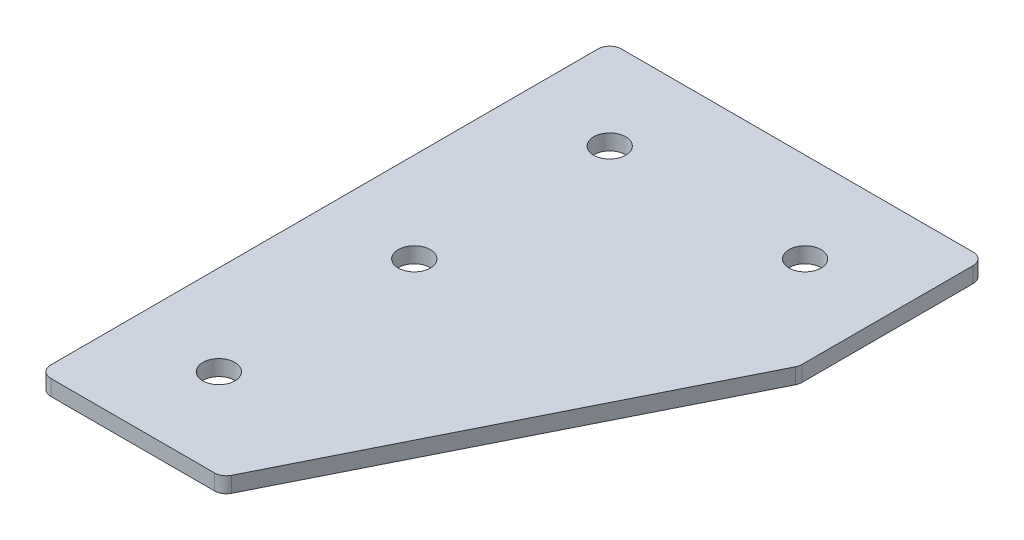
ISO-10303-21;
HEADER;
FILE_DESCRIPTION(('STEP AP214'),'2;1');
FILE_NAME('part.step','',(''),(''),'','','');
FILE_SCHEMA(('AUTOMOTIVE_DESIGN { 1 0 10303 214 1 1 1 1 }'));
ENDSEC;
DATA;
#1=APPLICATION_CONTEXT('core data for automotive mechanical design processes');
#2=APPLICATION_PROTOCOL_DEFINITION('international standard','automotive_design',2000,#1);
#3=PRODUCT_CONTEXT('',#1,'mechanical');
#4=PRODUCT('Part','Part','',(#3));
#5=PRODUCT_RELATED_PRODUCT_CATEGORY('part','',(#4));
#6=PRODUCT_DEFINITION_FORMATION('','',#4);
#7=PRODUCT_DEFINITION_CONTEXT('part definition',#1,'design');
#8=PRODUCT_DEFINITION('design','',#6,#7);
#9=PRODUCT_DEFINITION_SHAPE('','',#8);
#10=(LENGTH_UNIT() NAMED_UNIT(*) SI_UNIT(.MILLI.,.METRE.));
#11=(NAMED_UNIT(*) PLANE_ANGLE_UNIT() SI_UNIT($,.RADIAN.));
#12=(NAMED_UNIT(*) SI_UNIT($,.STERADIAN.) SOLID_ANGLE_UNIT());
#13=UNCERTAINTY_MEASURE_WITH_UNIT(LENGTH_MEASURE(1.E-05),#10,'distance_accuracy_value','');
#14=(GEOMETRIC_REPRESENTATION_CONTEXT(3) GLOBAL_UNCERTAINTY_ASSIGNED_CONTEXT((#13)) GLOBAL_UNIT_ASSIGNED_CONTEXT((#10,
#11,#12)) REPRESENTATION_CONTEXT('',''));
#15=CARTESIAN_POINT('',(0.,0.,0.));
#16=DIRECTION('',(0.,0.,1.));
#17=DIRECTION('',(1.,0.,0.));
#18=AXIS2_PLACEMENT_3D('',#15,#16,#17);
#19=CARTESIAN_POINT('',(-26.5038164553971,0.05807034319605,-50.5539194208949));
#20=DIRECTION('',(0.,-1.,0.));
#21=DIRECTION('',(0.,0.,-1.));
#22=AXIS2_PLACEMENT_3D('',#19,#20,#21);
#23=PLANE('',#22);
#24=CARTESIAN_POINT('',(-26.5038164553971,0.05807034319605,49.4460805791051));
#25=DIRECTION('',(0.,1.,0.));
#26=DIRECTION('',(0.,0.,1.));
#27=AXIS2_PLACEMENT_3D('',#24,#25,#26);
#28=CIRCLE('',#27,4.1);
#29=CARTESIAN_POINT('',(-26.5038164553971,0.05807034319605,53.5460805791051));
#30=VERTEX_POINT('',#29);
#31=EDGE_CURVE('E245',#30,#30,#28,.T.);
#32=ORIENTED_EDGE('',*,*,#31,.T.);
#33=EDGE_LOOP('',(#32));
#34=FACE_BOUND('',#33,.T.);
#35=CARTESIAN_POINT('',(-26.5038164553971,0.05807034319605,-0.553919420894944));
#36=DIRECTION('',(0.,1.,0.));
#37=DIRECTION('',(0.,0.,1.));
#38=AXIS2_PLACEMENT_3D('',#35,#36,#37);
#39=CIRCLE('',#38,4.1);
#40=CARTESIAN_POINT('',(-26.5038164553971,0.05807034319605,3.54608057910506));
#41=VERTEX_POINT('',#40);
#42=EDGE_CURVE('E253',#41,#41,#39,.T.);
#43=ORIENTED_EDGE('',*,*,#42,.T.);
#44=EDGE_LOOP('',(#43));
#45=FACE_BOUND('',#44,.T.);
#46=CARTESIAN_POINT('',(23.4961835446029,0.05807034319605,-50.5539194208949));
#47=DIRECTION('',(0.,1.,0.));
#48=DIRECTION('',(0.,0.,1.));
#49=AXIS2_PLACEMENT_3D('',#46,#47,#48);
#50=CIRCLE('',#49,4.1);
#51=CARTESIAN_POINT('',(23.4961835446029,0.05807034319605,-46.4539194208949));
#52=VERTEX_POINT('',#51);
#53=EDGE_CURVE('E259',#52,#52,#50,.T.);
#54=ORIENTED_EDGE('',*,*,#53,.T.);
#55=EDGE_LOOP('',(#54));
#56=FACE_BOUND('',#55,.T.);
#57=CARTESIAN_POINT('',(-26.5038164553971,0.05807034319605,-50.5539194208949));
#58=DIRECTION('',(0.,1.,0.));
#59=DIRECTION('',(0.,0.,1.));
#60=AXIS2_PLACEMENT_3D('',#57,#58,#59);
#61=CIRCLE('',#60,4.1);
#62=CARTESIAN_POINT('',(-26.5038164553971,0.05807034319605,-46.4539194208949));
#63=VERTEX_POINT('',#62);
#64=EDGE_CURVE('E176',#63,#63,#61,.T.);
#65=ORIENTED_EDGE('',*,*,#64,.T.);
#66=EDGE_LOOP('',(#65));
#67=FACE_BOUND('',#66,.T.);
#68=DIRECTION('',(1.,0.,0.));
#69=VECTOR('',#68,1.);
#70=CARTESIAN_POINT('',(-49.5038164553971,0.05807034319605,72.446080579105));
#71=LINE('',#70,#69);
#72=CARTESIAN_POINT('',(-46.5038164553971,0.05807034319605,72.446080579105));
#73=VERTEX_POINT('',#72);
#74=CARTESIAN_POINT('',(-4.59398639914657,0.05807034319605,72.4460805791049));
#75=VERTEX_POINT('',#74);
#76=EDGE_CURVE('E165',#73,#75,#71,.T.);
#77=ORIENTED_EDGE('',*,*,#76,.F.);
#78=CARTESIAN_POINT('',(-46.5038164553971,0.05807034319605,69.446080579105));
#79=DIRECTION('',(0.,-1.,0.));
#80=DIRECTION('',(0.,0.,-1.));
#81=AXIS2_PLACEMENT_3D('',#78,#79,#80);
#82=CIRCLE('',#81,3.);
#83=CARTESIAN_POINT('',(-49.5038164553971,0.05807034319605,69.446080579105));
#84=VERTEX_POINT('',#83);
#85=EDGE_CURVE('E146',#73,#84,#82,.T.);
#86=ORIENTED_EDGE('',*,*,#85,.T.);
#87=DIRECTION('',(0.,0.,1.));
#88=VECTOR('',#87,1.);
#89=CARTESIAN_POINT('',(-49.5038164553971,0.05807034319605,-73.553919420895));
#90=LINE('',#89,#88);
#91=CARTESIAN_POINT('',(-49.5038164553971,0.05807034319605,-70.553919420895));
#92=VERTEX_POINT('',#91);
#93=EDGE_CURVE('E163',#92,#84,#90,.T.);
#94=ORIENTED_EDGE('',*,*,#93,.F.);
#95=CARTESIAN_POINT('',(-46.5038164553971,0.05807034319605,-70.553919420895));
#96=DIRECTION('',(0.,-1.,0.));
#97=DIRECTION('',(0.,0.,-1.));
#98=AXIS2_PLACEMENT_3D('',#95,#96,#97);
#99=CIRCLE('',#98,3.);
#100=CARTESIAN_POINT('',(-46.5038164553971,0.05807034319605,-73.553919420895));
#101=VERTEX_POINT('',#100);
#102=EDGE_CURVE('E117',#92,#101,#99,.T.);
#103=ORIENTED_EDGE('',*,*,#102,.T.);
#104=DIRECTION('',(-1.,0.,0.));
#105=VECTOR('',#104,1.);
#106=CARTESIAN_POINT('',(46.4961835446029,0.05807034319605,-73.553919420895));
#107=LINE('',#106,#105);
#108=CARTESIAN_POINT('',(43.4961835446029,0.05807034319605,-73.553919420895));
#109=VERTEX_POINT('',#108);
#110=EDGE_CURVE('E161',#109,#101,#107,.T.);
#111=ORIENTED_EDGE('',*,*,#110,.F.);
#112=CARTESIAN_POINT('',(43.4961835446029,0.05807034319605,-70.553919420895));
#113=DIRECTION('',(0.,-1.,0.));
#114=DIRECTION('',(0.,0.,-1.));
#115=AXIS2_PLACEMENT_3D('',#112,#113,#114);
#116=CIRCLE('',#115,3.);
#117=CARTESIAN_POINT('',(46.4961835446029,0.05807034319605,-70.553919420895));
#118=VERTEX_POINT('',#117);
#119=EDGE_CURVE('E141',#109,#118,#116,.T.);
#120=ORIENTED_EDGE('',*,*,#119,.T.);
#121=DIRECTION('',(0.,0.,-1.));
#122=VECTOR('',#121,1.);
#123=CARTESIAN_POINT('',(46.4961835446029,0.05807034319605,-26.0260553758945));
#124=LINE('',#123,#122);
#125=CARTESIAN_POINT('',(46.4961835446029,0.05807034319605,-26.7342593083939));
#126=VERTEX_POINT('',#125);
#127=EDGE_CURVE('E118',#126,#118,#124,.T.);
#128=ORIENTED_EDGE('',*,*,#127,.F.);
#129=CARTESIAN_POINT('',(43.4961835446029,0.05807034319605,-26.7342593083939));
#130=DIRECTION('',(0.,-1.,0.));
#131=DIRECTION('',(0.,0.,-1.));
#132=AXIS2_PLACEMENT_3D('',#129,#130,#131);
#133=CIRCLE('',#132,3.);
#134=CARTESIAN_POINT('',(46.1794651176026,0.05807034319605,-25.392618521894));
#135=VERTEX_POINT('',#134);
#136=EDGE_CURVE('E31',#126,#135,#133,.T.);
#137=ORIENTED_EDGE('',*,*,#136,.T.);
#138=DIRECTION('',(0.447213595499958,0.,-0.894427190999916));
#139=VECTOR('',#138,1.);
#140=CARTESIAN_POINT('',(-2.73988443289688,0.05807034319605,72.4460805791049));
#141=LINE('',#140,#139);
#142=CARTESIAN_POINT('',(-1.91070482614681,0.05807034319605,70.7877213656048));
#143=VERTEX_POINT('',#142);
#144=EDGE_CURVE('E122',#143,#135,#141,.T.);
#145=ORIENTED_EDGE('',*,*,#144,.F.);
#146=CARTESIAN_POINT('',(-4.59398639914656,0.05807034319605,69.4460805791049));
#147=DIRECTION('',(0.,-1.,0.));
#148=DIRECTION('',(0.,0.,-1.));
#149=AXIS2_PLACEMENT_3D('',#146,#147,#148);
#150=CIRCLE('',#149,3.);
#151=EDGE_CURVE('E144',#143,#75,#150,.T.);
#152=ORIENTED_EDGE('',*,*,#151,.T.);
#153=EDGE_LOOP('',(#77,#86,#94,#103,#111,#120,#128,#137,#145,#152));
#154=FACE_BOUND('',#153,.T.);
#155=ADVANCED_FACE('F16',(#34,#45,#56,#67,#154),#23,.T.);
#156=CARTESIAN_POINT('',(46.4961835446029,0.05807034319605,-73.553919420895));
#157=DIRECTION('',(0.,0.,-1.));
#158=DIRECTION('',(-1.,0.,0.));
#159=AXIS2_PLACEMENT_3D('',#156,#157,#158);
#160=PLANE('',#159);
#161=DIRECTION('',(-1.,0.,0.));
#162=VECTOR('',#161,1.);
#163=CARTESIAN_POINT('',(46.4961835446029,4.05807034319605,-73.553919420895));
#164=LINE('',#163,#162);
#165=CARTESIAN_POINT('',(43.4961835446029,4.05807034319605,-73.553919420895));
#166=VERTEX_POINT('',#165);
#167=CARTESIAN_POINT('',(-46.5038164553971,4.05807034319605,-73.553919420895));
#168=VERTEX_POINT('',#167);
#169=EDGE_CURVE('E99',#166,#168,#164,.T.);
#170=ORIENTED_EDGE('',*,*,#169,.F.);
#171=DIRECTION('',(0.,1.,0.));
#172=VECTOR('',#171,1.);
#173=CARTESIAN_POINT('',(43.4961835446029,0.05807034319605,-73.553919420895));
#174=LINE('',#173,#172);
#175=EDGE_CURVE('E10',#166,#109,#174,.F.);
#176=ORIENTED_EDGE('',*,*,#175,.T.);
#177=ORIENTED_EDGE('',*,*,#110,.T.);
#178=DIRECTION('',(0.,1.,0.));
#179=VECTOR('',#178,1.);
#180=CARTESIAN_POINT('',(-46.5038164553971,0.05807034319605,-73.553919420895));
#181=LINE('',#180,#179);
#182=EDGE_CURVE('E24',#101,#168,#181,.T.);
#183=ORIENTED_EDGE('',*,*,#182,.T.);
#184=EDGE_LOOP('',(#170,#176,#177,#183));
#185=FACE_BOUND('',#184,.T.);
#186=ADVANCED_FACE('F158',(#185),#160,.T.);
#187=CARTESIAN_POINT('',(46.4961835446029,0.05807034319605,-26.0260553758945));
#188=DIRECTION('',(1.,0.,0.));
#189=DIRECTION('',(0.,0.,-1.));
#190=AXIS2_PLACEMENT_3D('',#187,#188,#189);
#191=PLANE('',#190);
#192=DIRECTION('',(0.,0.,-1.));
#193=VECTOR('',#192,1.);
#194=CARTESIAN_POINT('',(46.4961835446029,4.05807034319605,-26.0260553758945));
#195=LINE('',#194,#193);
#196=CARTESIAN_POINT('',(46.4961835446029,4.05807034319605,-26.7342593083939));
#197=VERTEX_POINT('',#196);
#198=CARTESIAN_POINT('',(46.4961835446029,4.05807034319605,-70.553919420895));
#199=VERTEX_POINT('',#198);
#200=EDGE_CURVE('E125',#197,#199,#195,.T.);
#201=ORIENTED_EDGE('',*,*,#200,.F.);
#202=DIRECTION('',(0.,1.,0.));
#203=VECTOR('',#202,1.);
#204=CARTESIAN_POINT('',(46.4961835446029,0.05807034319605,-26.7342593083939));
#205=LINE('',#204,#203);
#206=EDGE_CURVE('E155',#197,#126,#205,.F.);
#207=ORIENTED_EDGE('',*,*,#206,.T.);
#208=ORIENTED_EDGE('',*,*,#127,.T.);
#209=DIRECTION('',(0.,1.,0.));
#210=VECTOR('',#209,1.);
#211=CARTESIAN_POINT('',(46.4961835446029,0.05807034319605,-70.553919420895));
#212=LINE('',#211,#210);
#213=EDGE_CURVE('E152',#118,#199,#212,.T.);
#214=ORIENTED_EDGE('',*,*,#213,.T.);
#215=EDGE_LOOP('',(#201,#207,#208,#214));
#216=FACE_BOUND('',#215,.T.);
#217=ADVANCED_FACE('F212',(#216),#191,.T.);
#218=CARTESIAN_POINT('',(-2.73988443289688,0.05807034319605,72.4460805791049));
#219=DIRECTION('',(0.894427190999916,0.,0.447213595499958));
#220=DIRECTION('',(0.447213595499958,0.,-0.894427190999916));
#221=AXIS2_PLACEMENT_3D('',#218,#219,#220);
#222=PLANE('',#221);
#223=DIRECTION('',(0.447213595499958,0.,-0.894427190999916));
#224=VECTOR('',#223,1.);
#225=CARTESIAN_POINT('',(-2.73988443289688,4.05807034319605,72.4460805791049));
#226=LINE('',#225,#224);
#227=CARTESIAN_POINT('',(-1.91070482614681,4.05807034319605,70.7877213656048));
#228=VERTEX_POINT('',#227);
#229=CARTESIAN_POINT('',(46.1794651176026,4.05807034319605,-25.392618521894));
#230=VERTEX_POINT('',#229);
#231=EDGE_CURVE('E168',#228,#230,#226,.T.);
#232=ORIENTED_EDGE('',*,*,#231,.F.);
#233=DIRECTION('',(0.,1.,0.));
#234=VECTOR('',#233,1.);
#235=CARTESIAN_POINT('',(-1.91070482614681,0.05807034319605,70.7877213656048));
#236=LINE('',#235,#234);
#237=EDGE_CURVE('E38',#228,#143,#236,.F.);
#238=ORIENTED_EDGE('',*,*,#237,.T.);
#239=ORIENTED_EDGE('',*,*,#144,.T.);
#240=DIRECTION('',(0.,1.,0.));
#241=VECTOR('',#240,1.);
#242=CARTESIAN_POINT('',(46.1794651176027,0.05807034319605,-25.392618521894));
#243=LINE('',#242,#241);
#244=EDGE_CURVE('E148',#135,#230,#243,.T.);
#245=ORIENTED_EDGE('',*,*,#244,.T.);
#246=EDGE_LOOP('',(#232,#238,#239,#245));
#247=FACE_BOUND('',#246,.T.);
#248=ADVANCED_FACE('F181',(#247),#222,.T.);
#249=CARTESIAN_POINT('',(-49.5038164553971,0.05807034319605,72.446080579105));
#250=DIRECTION('',(0.,0.,1.));
#251=DIRECTION('',(1.,0.,0.));
#252=AXIS2_PLACEMENT_3D('',#249,#250,#251);
#253=PLANE('',#252);
#254=DIRECTION('',(1.,0.,0.));
#255=VECTOR('',#254,1.);
#256=CARTESIAN_POINT('',(-49.5038164553971,4.05807034319605,72.446080579105));
#257=LINE('',#256,#255);
#258=CARTESIAN_POINT('',(-46.5038164553971,4.05807034319605,72.446080579105));
#259=VERTEX_POINT('',#258);
#260=CARTESIAN_POINT('',(-4.59398639914657,4.05807034319605,72.4460805791049));
#261=VERTEX_POINT('',#260);
#262=EDGE_CURVE('E114',#259,#261,#257,.T.);
#263=ORIENTED_EDGE('',*,*,#262,.F.);
#264=DIRECTION('',(0.,1.,0.));
#265=VECTOR('',#264,1.);
#266=CARTESIAN_POINT('',(-46.5038164553971,0.05807034319605,72.446080579105));
#267=LINE('',#266,#265);
#268=EDGE_CURVE('E138',#259,#73,#267,.F.);
#269=ORIENTED_EDGE('',*,*,#268,.T.);
#270=ORIENTED_EDGE('',*,*,#76,.T.);
#271=DIRECTION('',(0.,1.,0.));
#272=VECTOR('',#271,1.);
#273=CARTESIAN_POINT('',(-4.59398639914656,0.05807034319605,72.4460805791049));
#274=LINE('',#273,#272);
#275=EDGE_CURVE('E135',#75,#261,#274,.T.);
#276=ORIENTED_EDGE('',*,*,#275,.T.);
#277=EDGE_LOOP('',(#263,#269,#270,#276));
#278=FACE_BOUND('',#277,.T.);
#279=ADVANCED_FACE('F191',(#278),#253,.T.);
#280=CARTESIAN_POINT('',(-49.5038164553971,0.05807034319605,-73.553919420895));
#281=DIRECTION('',(-1.,0.,0.));
#282=DIRECTION('',(0.,0.,1.));
#283=AXIS2_PLACEMENT_3D('',#280,#281,#282);
#284=PLANE('',#283);
#285=ORIENTED_EDGE('',*,*,#93,.T.);
#286=DIRECTION('',(0.,1.,0.));
#287=VECTOR('',#286,1.);
#288=CARTESIAN_POINT('',(-49.5038164553971,0.05807034319605,69.446080579105));
#289=LINE('',#288,#287);
#290=CARTESIAN_POINT('',(-49.5038164553971,4.05807034319605,69.446080579105));
#291=VERTEX_POINT('',#290);
#292=EDGE_CURVE('E105',#84,#291,#289,.T.);
#293=ORIENTED_EDGE('',*,*,#292,.T.);
#294=DIRECTION('',(0.,0.,1.));
#295=VECTOR('',#294,1.);
#296=CARTESIAN_POINT('',(-49.5038164553971,4.05807034319605,-73.553919420895));
#297=LINE('',#296,#295);
#298=CARTESIAN_POINT('',(-49.5038164553971,4.05807034319605,-70.553919420895));
#299=VERTEX_POINT('',#298);
#300=EDGE_CURVE('E97',#299,#291,#297,.T.);
#301=ORIENTED_EDGE('',*,*,#300,.F.);
#302=DIRECTION('',(0.,1.,0.));
#303=VECTOR('',#302,1.);
#304=CARTESIAN_POINT('',(-49.5038164553971,0.05807034319605,-70.553919420895));
#305=LINE('',#304,#303);
#306=EDGE_CURVE('E111',#299,#92,#305,.F.);
#307=ORIENTED_EDGE('',*,*,#306,.T.);
#308=EDGE_LOOP('',(#285,#293,#301,#307));
#309=FACE_BOUND('',#308,.T.);
#310=ADVANCED_FACE('F110',(#309),#284,.T.);
#311=CARTESIAN_POINT('',(-26.5038164553971,4.05807034319605,-50.5539194208949));
#312=DIRECTION('',(0.,-1.,0.));
#313=DIRECTION('',(0.,0.,-1.));
#314=AXIS2_PLACEMENT_3D('',#311,#312,#313);
#315=PLANE('',#314);
#316=CARTESIAN_POINT('',(-26.5038164553971,4.05807034319605,49.4460805791051));
#317=DIRECTION('',(0.,1.,0.));
#318=DIRECTION('',(0.,0.,1.));
#319=AXIS2_PLACEMENT_3D('',#316,#317,#318);
#320=CIRCLE('',#319,4.1);
#321=CARTESIAN_POINT('',(-26.5038164553971,4.05807034319605,53.5460805791051));
#322=VERTEX_POINT('',#321);
#323=EDGE_CURVE('E248',#322,#322,#320,.T.);
#324=ORIENTED_EDGE('',*,*,#323,.F.);
#325=EDGE_LOOP('',(#324));
#326=FACE_BOUND('',#325,.T.);
#327=CARTESIAN_POINT('',(-26.5038164553971,4.05807034319605,-0.553919420894944));
#328=DIRECTION('',(0.,1.,0.));
#329=DIRECTION('',(0.,0.,1.));
#330=AXIS2_PLACEMENT_3D('',#327,#328,#329);
#331=CIRCLE('',#330,4.1);
#332=CARTESIAN_POINT('',(-26.5038164553971,4.05807034319605,3.54608057910506));
#333=VERTEX_POINT('',#332);
#334=EDGE_CURVE('E250',#333,#333,#331,.T.);
#335=ORIENTED_EDGE('',*,*,#334,.F.);
#336=EDGE_LOOP('',(#335));
#337=FACE_BOUND('',#336,.T.);
#338=CARTESIAN_POINT('',(23.4961835446029,4.05807034319605,-50.5539194208949));
#339=DIRECTION('',(0.,1.,0.));
#340=DIRECTION('',(0.,0.,1.));
#341=AXIS2_PLACEMENT_3D('',#338,#339,#340);
#342=CIRCLE('',#341,4.1);
#343=CARTESIAN_POINT('',(23.4961835446029,4.05807034319605,-46.4539194208949));
#344=VERTEX_POINT('',#343);
#345=EDGE_CURVE('E256',#344,#344,#342,.T.);
#346=ORIENTED_EDGE('',*,*,#345,.F.);
#347=EDGE_LOOP('',(#346));
#348=FACE_BOUND('',#347,.T.);
#349=CARTESIAN_POINT('',(-26.5038164553971,4.05807034319605,-50.5539194208949));
#350=DIRECTION('',(0.,1.,0.));
#351=DIRECTION('',(0.,0.,1.));
#352=AXIS2_PLACEMENT_3D('',#349,#350,#351);
#353=CIRCLE('',#352,4.1);
#354=CARTESIAN_POINT('',(-26.5038164553971,4.05807034319605,-46.4539194208949));
#355=VERTEX_POINT('',#354);
#356=EDGE_CURVE('E170',#355,#355,#353,.T.);
#357=ORIENTED_EDGE('',*,*,#356,.F.);
#358=EDGE_LOOP('',(#357));
#359=FACE_BOUND('',#358,.T.);
#360=ORIENTED_EDGE('',*,*,#300,.T.);
#361=CARTESIAN_POINT('',(-46.5038164553971,4.05807034319605,69.446080579105));
#362=DIRECTION('',(0.,-1.,0.));
#363=DIRECTION('',(0.,0.,-1.));
#364=AXIS2_PLACEMENT_3D('',#361,#362,#363);
#365=CIRCLE('',#364,3.);
#366=EDGE_CURVE('E133',#291,#259,#365,.F.);
#367=ORIENTED_EDGE('',*,*,#366,.T.);
#368=ORIENTED_EDGE('',*,*,#262,.T.);
#369=CARTESIAN_POINT('',(-4.59398639914656,4.05807034319605,69.4460805791049));
#370=DIRECTION('',(0.,-1.,0.));
#371=DIRECTION('',(0.,0.,-1.));
#372=AXIS2_PLACEMENT_3D('',#369,#370,#371);
#373=CIRCLE('',#372,3.);
#374=EDGE_CURVE('E131',#261,#228,#373,.F.);
#375=ORIENTED_EDGE('',*,*,#374,.T.);
#376=ORIENTED_EDGE('',*,*,#231,.T.);
#377=CARTESIAN_POINT('',(43.4961835446029,4.05807034319605,-26.7342593083939));
#378=DIRECTION('',(0.,-1.,0.));
#379=DIRECTION('',(0.,0.,-1.));
#380=AXIS2_PLACEMENT_3D('',#377,#378,#379);
#381=CIRCLE('',#380,3.);
#382=EDGE_CURVE('E129',#230,#197,#381,.F.);
#383=ORIENTED_EDGE('',*,*,#382,.T.);
#384=ORIENTED_EDGE('',*,*,#200,.T.);
#385=CARTESIAN_POINT('',(43.4961835446029,4.05807034319605,-70.553919420895));
#386=DIRECTION('',(0.,-1.,0.));
#387=DIRECTION('',(0.,0.,-1.));
#388=AXIS2_PLACEMENT_3D('',#385,#386,#387);
#389=CIRCLE('',#388,3.);
#390=EDGE_CURVE('E104',#199,#166,#389,.F.);
#391=ORIENTED_EDGE('',*,*,#390,.T.);
#392=ORIENTED_EDGE('',*,*,#169,.T.);
#393=CARTESIAN_POINT('',(-46.5038164553971,4.05807034319605,-70.553919420895));
#394=DIRECTION('',(0.,-1.,0.));
#395=DIRECTION('',(0.,0.,-1.));
#396=AXIS2_PLACEMENT_3D('',#393,#394,#395);
#397=CIRCLE('',#396,3.);
#398=EDGE_CURVE('E94',#168,#299,#397,.F.);
#399=ORIENTED_EDGE('',*,*,#398,.T.);
#400=EDGE_LOOP('',(#360,#367,#368,#375,#376,#383,#384,#391,#392,#399));
#401=FACE_BOUND('',#400,.T.);
#402=ADVANCED_FACE('F96',(#326,#337,#348,#359,#401),#315,.F.);
#403=CARTESIAN_POINT('',(-46.5038164553971,0.05807034319605,69.446080579105));
#404=DIRECTION('',(0.,1.,0.));
#405=DIRECTION('',(0.,0.,1.));
#406=AXIS2_PLACEMENT_3D('',#403,#404,#405);
#407=CYLINDRICAL_SURFACE('',#406,3.);
#408=ORIENTED_EDGE('',*,*,#85,.F.);
#409=ORIENTED_EDGE('',*,*,#268,.F.);
#410=ORIENTED_EDGE('',*,*,#366,.F.);
#411=ORIENTED_EDGE('',*,*,#292,.F.);
#412=EDGE_LOOP('',(#408,#409,#410,#411));
#413=FACE_BOUND('',#412,.T.);
#414=ADVANCED_FACE('F194',(#413),#407,.T.);
#415=CARTESIAN_POINT('',(-4.59398639914656,0.05807034319605,69.4460805791049));
#416=DIRECTION('',(0.,1.,0.));
#417=DIRECTION('',(0.,0.,1.));
#418=AXIS2_PLACEMENT_3D('',#415,#416,#417);
#419=CYLINDRICAL_SURFACE('',#418,3.);
#420=ORIENTED_EDGE('',*,*,#151,.F.);
#421=ORIENTED_EDGE('',*,*,#237,.F.);
#422=ORIENTED_EDGE('',*,*,#374,.F.);
#423=ORIENTED_EDGE('',*,*,#275,.F.);
#424=EDGE_LOOP('',(#420,#421,#422,#423));
#425=FACE_BOUND('',#424,.T.);
#426=ADVANCED_FACE('F185',(#425),#419,.T.);
#427=CARTESIAN_POINT('',(43.4961835446029,0.05807034319605,-26.7342593083939));
#428=DIRECTION('',(0.,1.,0.));
#429=DIRECTION('',(0.,0.,1.));
#430=AXIS2_PLACEMENT_3D('',#427,#428,#429);
#431=CYLINDRICAL_SURFACE('',#430,3.);
#432=ORIENTED_EDGE('',*,*,#136,.F.);
#433=ORIENTED_EDGE('',*,*,#206,.F.);
#434=ORIENTED_EDGE('',*,*,#382,.F.);
#435=ORIENTED_EDGE('',*,*,#244,.F.);
#436=EDGE_LOOP('',(#432,#433,#434,#435));
#437=FACE_BOUND('',#436,.T.);
#438=ADVANCED_FACE('F202',(#437),#431,.T.);
#439=CARTESIAN_POINT('',(43.4961835446029,0.05807034319605,-70.553919420895));
#440=DIRECTION('',(0.,1.,0.));
#441=DIRECTION('',(0.,0.,1.));
#442=AXIS2_PLACEMENT_3D('',#439,#440,#441);
#443=CYLINDRICAL_SURFACE('',#442,3.);
#444=ORIENTED_EDGE('',*,*,#119,.F.);
#445=ORIENTED_EDGE('',*,*,#175,.F.);
#446=ORIENTED_EDGE('',*,*,#390,.F.);
#447=ORIENTED_EDGE('',*,*,#213,.F.);
#448=EDGE_LOOP('',(#444,#445,#446,#447));
#449=FACE_BOUND('',#448,.T.);
#450=ADVANCED_FACE('F299',(#449),#443,.T.);
#451=CARTESIAN_POINT('',(-46.5038164553971,0.05807034319605,-70.553919420895));
#452=DIRECTION('',(0.,1.,0.));
#453=DIRECTION('',(0.,0.,1.));
#454=AXIS2_PLACEMENT_3D('',#451,#452,#453);
#455=CYLINDRICAL_SURFACE('',#454,3.);
#456=ORIENTED_EDGE('',*,*,#102,.F.);
#457=ORIENTED_EDGE('',*,*,#306,.F.);
#458=ORIENTED_EDGE('',*,*,#398,.F.);
#459=ORIENTED_EDGE('',*,*,#182,.F.);
#460=EDGE_LOOP('',(#456,#457,#458,#459));
#461=FACE_BOUND('',#460,.T.);
#462=ADVANCED_FACE('F18',(#461),#455,.T.);
#463=CARTESIAN_POINT('',(-26.5038164553971,0.05807034319605,-50.5539194208949));
#464=DIRECTION('',(0.,1.,0.));
#465=DIRECTION('',(0.,0.,1.));
#466=AXIS2_PLACEMENT_3D('',#463,#464,#465);
#467=CYLINDRICAL_SURFACE('',#466,4.1);
#468=ORIENTED_EDGE('',*,*,#64,.F.);
#469=EDGE_LOOP('',(#468));
#470=FACE_BOUND('',#469,.T.);
#471=ORIENTED_EDGE('',*,*,#356,.T.);
#472=EDGE_LOOP('',(#471));
#473=FACE_BOUND('',#472,.T.);
#474=ADVANCED_FACE('F226',(#470,#473),#467,.F.);
#475=CARTESIAN_POINT('',(23.4961835446029,0.05807034319605,-50.5539194208949));
#476=DIRECTION('',(0.,1.,0.));
#477=DIRECTION('',(0.,0.,1.));
#478=AXIS2_PLACEMENT_3D('',#475,#476,#477);
#479=CYLINDRICAL_SURFACE('',#478,4.1);
#480=ORIENTED_EDGE('',*,*,#53,.F.);
#481=EDGE_LOOP('',(#480));
#482=FACE_BOUND('',#481,.T.);
#483=ORIENTED_EDGE('',*,*,#345,.T.);
#484=EDGE_LOOP('',(#483));
#485=FACE_BOUND('',#484,.T.);
#486=ADVANCED_FACE('F229',(#482,#485),#479,.F.);
#487=CARTESIAN_POINT('',(-26.5038164553971,0.05807034319605,-0.553919420894944));
#488=DIRECTION('',(0.,1.,0.));
#489=DIRECTION('',(0.,0.,1.));
#490=AXIS2_PLACEMENT_3D('',#487,#488,#489);
#491=CYLINDRICAL_SURFACE('',#490,4.1);
#492=ORIENTED_EDGE('',*,*,#42,.F.);
#493=EDGE_LOOP('',(#492));
#494=FACE_BOUND('',#493,.T.);
#495=ORIENTED_EDGE('',*,*,#334,.T.);
#496=EDGE_LOOP('',(#495));
#497=FACE_BOUND('',#496,.T.);
#498=ADVANCED_FACE('F233',(#494,#497),#491,.F.);
#499=CARTESIAN_POINT('',(-26.5038164553971,0.05807034319605,49.4460805791051));
#500=DIRECTION('',(0.,1.,0.));
#501=DIRECTION('',(0.,0.,1.));
#502=AXIS2_PLACEMENT_3D('',#499,#500,#501);
#503=CYLINDRICAL_SURFACE('',#502,4.1);
#504=ORIENTED_EDGE('',*,*,#31,.F.);
#505=EDGE_LOOP('',(#504));
#506=FACE_BOUND('',#505,.T.);
#507=ORIENTED_EDGE('',*,*,#323,.T.);
#508=EDGE_LOOP('',(#507));
#509=FACE_BOUND('',#508,.T.);
#510=ADVANCED_FACE('F237',(#506,#509),#503,.F.);
#511=CLOSED_SHELL('',(#155,#186,#217,#248,#279,#310,#402,#414,#426,#438,#450,#462,#474,#486,
#498,#510));
#512=MANIFOLD_SOLID_BREP('B1',#511);
#513=ADVANCED_BREP_SHAPE_REPRESENTATION('',(#18,#512),#14);
#514=SHAPE_DEFINITION_REPRESENTATION(#9,#513);
ENDSEC;
END-ISO-10303-21;
